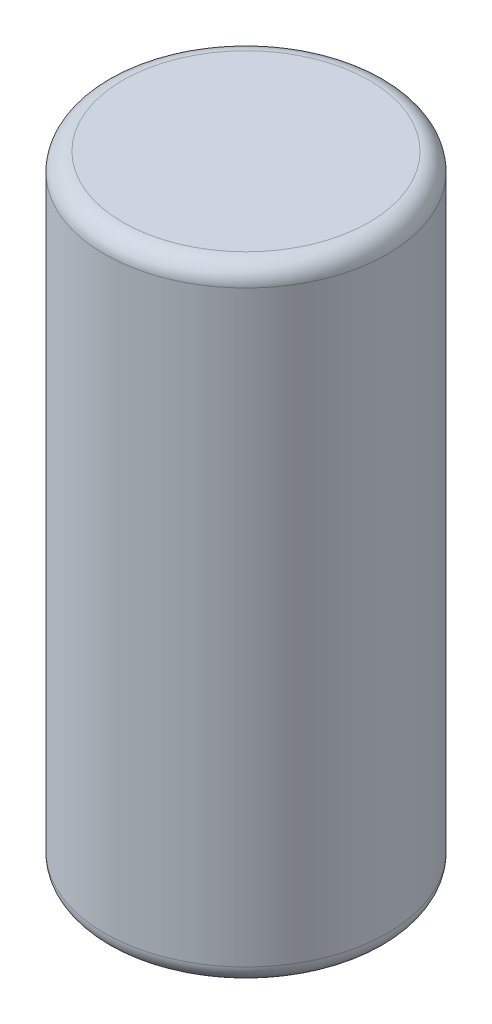
ISO-10303-21;
HEADER;
FILE_DESCRIPTION(('STEP AP214'),'2;1');
FILE_NAME('part.step','',(''),(''),'','','');
FILE_SCHEMA(('AUTOMOTIVE_DESIGN { 1 0 10303 214 1 1 1 1 }'));
ENDSEC;
DATA;
#1=APPLICATION_CONTEXT('core data for automotive mechanical design processes');
#2=APPLICATION_PROTOCOL_DEFINITION('international standard','automotive_design',2000,#1);
#3=PRODUCT_CONTEXT('',#1,'mechanical');
#4=PRODUCT('Part','Part','',(#3));
#5=PRODUCT_RELATED_PRODUCT_CATEGORY('part','',(#4));
#6=PRODUCT_DEFINITION_FORMATION('','',#4);
#7=PRODUCT_DEFINITION_CONTEXT('part definition',#1,'design');
#8=PRODUCT_DEFINITION('design','',#6,#7);
#9=PRODUCT_DEFINITION_SHAPE('','',#8);
#10=(LENGTH_UNIT() NAMED_UNIT(*) SI_UNIT(.MILLI.,.METRE.));
#11=(NAMED_UNIT(*) PLANE_ANGLE_UNIT() SI_UNIT($,.RADIAN.));
#12=(NAMED_UNIT(*) SI_UNIT($,.STERADIAN.) SOLID_ANGLE_UNIT());
#13=UNCERTAINTY_MEASURE_WITH_UNIT(LENGTH_MEASURE(1.E-05),#10,'distance_accuracy_value','');
#14=(GEOMETRIC_REPRESENTATION_CONTEXT(3) GLOBAL_UNCERTAINTY_ASSIGNED_CONTEXT((#13)) GLOBAL_UNIT_ASSIGNED_CONTEXT((#10,
#11,#12)) REPRESENTATION_CONTEXT('',''));
#15=CARTESIAN_POINT('',(0.,0.,0.));
#16=DIRECTION('',(0.,0.,1.));
#17=DIRECTION('',(1.,0.,0.));
#18=AXIS2_PLACEMENT_3D('',#15,#16,#17);
#19=CARTESIAN_POINT('',(0.,340.,0.));
#20=DIRECTION('',(0.,-1.,0.));
#21=DIRECTION('',(0.,0.,-1.));
#22=AXIS2_PLACEMENT_3D('',#19,#20,#21);
#23=CYLINDRICAL_SURFACE('',#22,77.);
#24=CARTESIAN_POINT('',(0.,330.,0.));
#25=DIRECTION('',(0.,1.,0.));
#26=DIRECTION('',(0.,0.,1.));
#27=AXIS2_PLACEMENT_3D('',#24,#25,#26);
#28=CIRCLE('',#27,77.);
#29=CARTESIAN_POINT('',(0.,330.,77.));
#30=VERTEX_POINT('',#29);
#31=EDGE_CURVE('E50',#30,#30,#28,.F.);
#32=ORIENTED_EDGE('',*,*,#31,.T.);
#33=EDGE_LOOP('',(#32));
#34=FACE_BOUND('',#33,.T.);
#35=CARTESIAN_POINT('',(0.,10.,0.));
#36=DIRECTION('',(0.,1.,0.));
#37=DIRECTION('',(0.,0.,1.));
#38=AXIS2_PLACEMENT_3D('',#35,#36,#37);
#39=CIRCLE('',#38,77.);
#40=CARTESIAN_POINT('',(0.,10.,77.));
#41=VERTEX_POINT('',#40);
#42=EDGE_CURVE('E54',#41,#41,#39,.T.);
#43=ORIENTED_EDGE('',*,*,#42,.T.);
#44=EDGE_LOOP('',(#43));
#45=FACE_BOUND('',#44,.T.);
#46=ADVANCED_FACE('F43',(#34,#45),#23,.T.);
#47=CARTESIAN_POINT('',(0.,340.,0.));
#48=DIRECTION('',(0.,1.,0.));
#49=DIRECTION('',(0.,0.,1.));
#50=AXIS2_PLACEMENT_3D('',#47,#48,#49);
#51=PLANE('',#50);
#52=CARTESIAN_POINT('',(0.,340.,0.));
#53=DIRECTION('',(0.,1.,0.));
#54=DIRECTION('',(0.,0.,1.));
#55=AXIS2_PLACEMENT_3D('',#52,#53,#54);
#56=CIRCLE('',#55,67.);
#57=CARTESIAN_POINT('',(0.,340.,67.));
#58=VERTEX_POINT('',#57);
#59=EDGE_CURVE('E58',#58,#58,#56,.T.);
#60=ORIENTED_EDGE('',*,*,#59,.T.);
#61=EDGE_LOOP('',(#60));
#62=FACE_BOUND('',#61,.T.);
#63=ADVANCED_FACE('F64',(#62),#51,.T.);
#64=CARTESIAN_POINT('',(0.,0.,0.));
#65=DIRECTION('',(0.,1.,0.));
#66=DIRECTION('',(0.,0.,1.));
#67=AXIS2_PLACEMENT_3D('',#64,#65,#66);
#68=PLANE('',#67);
#69=CARTESIAN_POINT('',(0.,0.,0.));
#70=DIRECTION('',(0.,1.,0.));
#71=DIRECTION('',(0.,0.,1.));
#72=AXIS2_PLACEMENT_3D('',#69,#70,#71);
#73=CIRCLE('',#72,67.);
#74=CARTESIAN_POINT('',(0.,0.,67.));
#75=VERTEX_POINT('',#74);
#76=EDGE_CURVE('E10',#75,#75,#73,.F.);
#77=ORIENTED_EDGE('',*,*,#76,.T.);
#78=EDGE_LOOP('',(#77));
#79=FACE_BOUND('',#78,.T.);
#80=ADVANCED_FACE('F68',(#79),#68,.F.);
#81=CARTESIAN_POINT('',(0.,330.,0.));
#82=DIRECTION('',(0.,1.,0.));
#83=DIRECTION('',(0.,0.,1.));
#84=AXIS2_PLACEMENT_3D('',#81,#82,#83);
#85=TOROIDAL_SURFACE('',#84,67.,10.);
#86=ORIENTED_EDGE('',*,*,#31,.F.);
#87=EDGE_LOOP('',(#86));
#88=FACE_BOUND('',#87,.T.);
#89=ORIENTED_EDGE('',*,*,#59,.F.);
#90=EDGE_LOOP('',(#89));
#91=FACE_BOUND('',#90,.T.);
#92=ADVANCED_FACE('F66',(#88,#91),#85,.T.);
#93=CARTESIAN_POINT('',(0.,10.,0.));
#94=DIRECTION('',(0.,1.,0.));
#95=DIRECTION('',(0.,0.,1.));
#96=AXIS2_PLACEMENT_3D('',#93,#94,#95);
#97=TOROIDAL_SURFACE('',#96,67.,10.);
#98=ORIENTED_EDGE('',*,*,#76,.F.);
#99=EDGE_LOOP('',(#98));
#100=FACE_BOUND('',#99,.T.);
#101=ORIENTED_EDGE('',*,*,#42,.F.);
#102=EDGE_LOOP('',(#101));
#103=FACE_BOUND('',#102,.T.);
#104=ADVANCED_FACE('F45',(#100,#103),#97,.T.);
#105=CLOSED_SHELL('',(#46,#63,#80,#92,#104));
#106=MANIFOLD_SOLID_BREP('B2',#105);
#107=ADVANCED_BREP_SHAPE_REPRESENTATION('',(#18,#106),#14);
#108=SHAPE_DEFINITION_REPRESENTATION(#9,#107);
ENDSEC;
END-ISO-10303-21;
